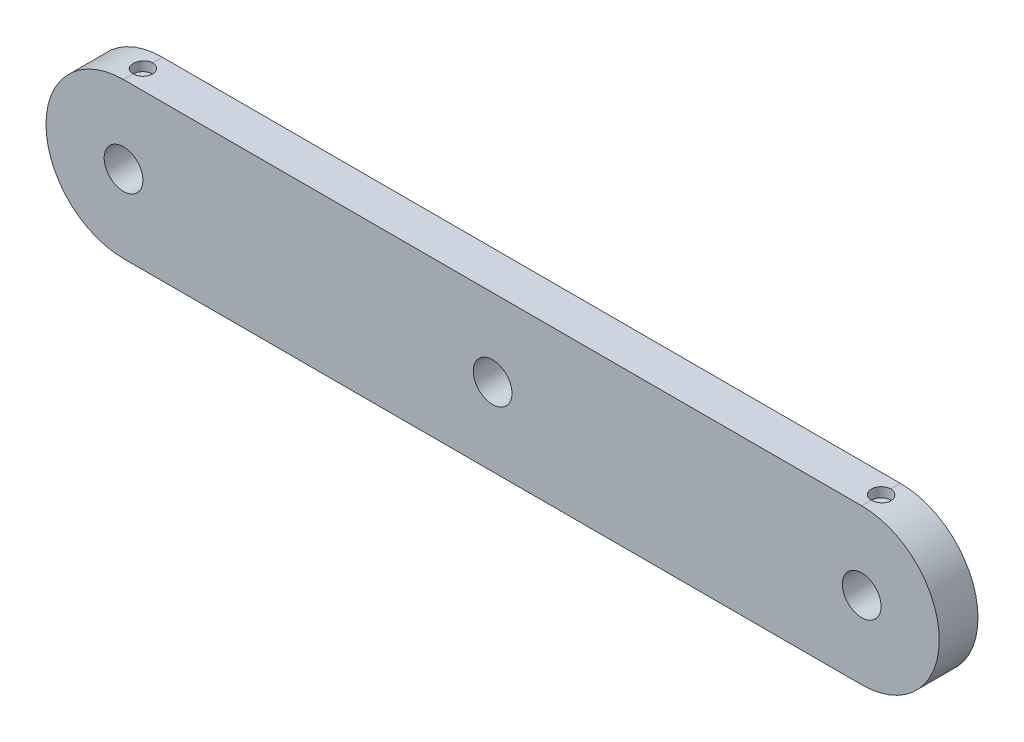
ISO-10303-21;
HEADER;
FILE_DESCRIPTION(('STEP AP214'),'2;1');
FILE_NAME('part.step','',(''),(''),'','','');
FILE_SCHEMA(('AUTOMOTIVE_DESIGN { 1 0 10303 214 1 1 1 1 }'));
ENDSEC;
DATA;
#1=APPLICATION_CONTEXT('core data for automotive mechanical design processes');
#2=APPLICATION_PROTOCOL_DEFINITION('international standard','automotive_design',2000,#1);
#3=PRODUCT_CONTEXT('',#1,'mechanical');
#4=PRODUCT('Part','Part','',(#3));
#5=PRODUCT_RELATED_PRODUCT_CATEGORY('part','',(#4));
#6=PRODUCT_DEFINITION_FORMATION('','',#4);
#7=PRODUCT_DEFINITION_CONTEXT('part definition',#1,'design');
#8=PRODUCT_DEFINITION('design','',#6,#7);
#9=PRODUCT_DEFINITION_SHAPE('','',#8);
#10=(LENGTH_UNIT() NAMED_UNIT(*) SI_UNIT(.MILLI.,.METRE.));
#11=(NAMED_UNIT(*) PLANE_ANGLE_UNIT() SI_UNIT($,.RADIAN.));
#12=(NAMED_UNIT(*) SI_UNIT($,.STERADIAN.) SOLID_ANGLE_UNIT());
#13=UNCERTAINTY_MEASURE_WITH_UNIT(LENGTH_MEASURE(1.E-05),#10,'distance_accuracy_value','');
#14=(GEOMETRIC_REPRESENTATION_CONTEXT(3) GLOBAL_UNCERTAINTY_ASSIGNED_CONTEXT((#13)) GLOBAL_UNIT_ASSIGNED_CONTEXT((#10,
#11,#12)) REPRESENTATION_CONTEXT('',''));
#15=CARTESIAN_POINT('',(0.,0.,0.));
#16=DIRECTION('',(0.,0.,1.));
#17=DIRECTION('',(1.,0.,0.));
#18=AXIS2_PLACEMENT_3D('',#15,#16,#17);
#19=CARTESIAN_POINT('',(-19.0419865714244,0.,2.));
#20=DIRECTION('',(0.,0.,1.));
#21=DIRECTION('',(1.,0.,0.));
#22=AXIS2_PLACEMENT_3D('',#19,#20,#21);
#23=PLANE('',#22);
#24=CARTESIAN_POINT('',(-19.0419865714244,0.,2.));
#25=DIRECTION('',(0.,0.,1.));
#26=DIRECTION('',(1.,0.,0.));
#27=AXIS2_PLACEMENT_3D('',#24,#25,#26);
#28=CIRCLE('',#27,0.999999999999943);
#29=CARTESIAN_POINT('',(-18.0419865714244,0.,2.));
#30=VERTEX_POINT('',#29);
#31=EDGE_CURVE('E133',#30,#30,#28,.T.);
#32=ORIENTED_EDGE('',*,*,#31,.F.);
#33=EDGE_LOOP('',(#32));
#34=FACE_BOUND('',#33,.T.);
#35=CARTESIAN_POINT('',(-19.0419865714244,0.,2.));
#36=DIRECTION('',(0.,0.,1.));
#37=DIRECTION('',(1.,0.,0.));
#38=AXIS2_PLACEMENT_3D('',#35,#36,#37);
#39=CIRCLE('',#38,3.99999999999989);
#40=CARTESIAN_POINT('',(-19.0419865714246,3.99999999999995,2.));
#41=VERTEX_POINT('',#40);
#42=CARTESIAN_POINT('',(-19.0419865714244,-3.99999999999984,2.));
#43=VERTEX_POINT('',#42);
#44=EDGE_CURVE('E114',#41,#43,#39,.T.);
#45=ORIENTED_EDGE('',*,*,#44,.T.);
#46=DIRECTION('',(1.,0.,0.));
#47=VECTOR('',#46,1.);
#48=CARTESIAN_POINT('',(-19.0419865714244,-3.99999999999984,2.));
#49=LINE('',#48,#47);
#50=CARTESIAN_POINT('',(19.0419865714246,-3.99999999999995,2.));
#51=VERTEX_POINT('',#50);
#52=EDGE_CURVE('E126',#43,#51,#49,.T.);
#53=ORIENTED_EDGE('',*,*,#52,.T.);
#54=CARTESIAN_POINT('',(19.0419865714246,0.,2.));
#55=DIRECTION('',(0.,0.,1.));
#56=DIRECTION('',(1.,0.,0.));
#57=AXIS2_PLACEMENT_3D('',#54,#55,#56);
#58=CIRCLE('',#57,3.99999999999989);
#59=CARTESIAN_POINT('',(19.0419865714246,3.99999999999995,2.));
#60=VERTEX_POINT('',#59);
#61=EDGE_CURVE('E124',#51,#60,#58,.T.);
#62=ORIENTED_EDGE('',*,*,#61,.T.);
#63=DIRECTION('',(-1.,0.,0.));
#64=VECTOR('',#63,1.);
#65=CARTESIAN_POINT('',(-19.0419865714246,3.99999999999995,2.));
#66=LINE('',#65,#64);
#67=EDGE_CURVE('E103',#60,#41,#66,.T.);
#68=ORIENTED_EDGE('',*,*,#67,.T.);
#69=EDGE_LOOP('',(#45,#53,#62,#68));
#70=FACE_BOUND('',#69,.T.);
#71=CARTESIAN_POINT('',(0.,0.,2.));
#72=DIRECTION('',(0.,0.,1.));
#73=DIRECTION('',(1.,0.,0.));
#74=AXIS2_PLACEMENT_3D('',#71,#72,#73);
#75=CIRCLE('',#74,1.00000000000007);
#76=CARTESIAN_POINT('',(1.00000000000007,0.,2.));
#77=VERTEX_POINT('',#76);
#78=EDGE_CURVE('E122',#77,#77,#75,.T.);
#79=ORIENTED_EDGE('',*,*,#78,.F.);
#80=EDGE_LOOP('',(#79));
#81=FACE_BOUND('',#80,.T.);
#82=CARTESIAN_POINT('',(19.0419865714246,0.,2.));
#83=DIRECTION('',(0.,0.,1.));
#84=DIRECTION('',(1.,0.,0.));
#85=AXIS2_PLACEMENT_3D('',#82,#83,#84);
#86=CIRCLE('',#85,1.00000000000007);
#87=CARTESIAN_POINT('',(20.0419865714247,0.,2.));
#88=VERTEX_POINT('',#87);
#89=EDGE_CURVE('E139',#88,#88,#86,.T.);
#90=ORIENTED_EDGE('',*,*,#89,.F.);
#91=EDGE_LOOP('',(#90));
#92=FACE_BOUND('',#91,.T.);
#93=ADVANCED_FACE('F32',(#34,#70,#81,#92),#23,.T.);
#94=CARTESIAN_POINT('',(-19.0419865714244,0.,0.));
#95=DIRECTION('',(0.,0.,1.));
#96=DIRECTION('',(1.,0.,0.));
#97=AXIS2_PLACEMENT_3D('',#94,#95,#96);
#98=PLANE('',#97);
#99=CARTESIAN_POINT('',(-19.0419865714244,0.,0.));
#100=DIRECTION('',(0.,0.,1.));
#101=DIRECTION('',(1.,0.,0.));
#102=AXIS2_PLACEMENT_3D('',#99,#100,#101);
#103=CIRCLE('',#102,0.999999999999943);
#104=CARTESIAN_POINT('',(-18.0419865714244,0.,0.));
#105=VERTEX_POINT('',#104);
#106=EDGE_CURVE('E136',#105,#105,#103,.T.);
#107=ORIENTED_EDGE('',*,*,#106,.T.);
#108=EDGE_LOOP('',(#107));
#109=FACE_BOUND('',#108,.T.);
#110=CARTESIAN_POINT('',(-19.0419865714244,0.,0.));
#111=DIRECTION('',(0.,0.,1.));
#112=DIRECTION('',(1.,0.,0.));
#113=AXIS2_PLACEMENT_3D('',#110,#111,#112);
#114=CIRCLE('',#113,3.99999999999989);
#115=CARTESIAN_POINT('',(-19.0419865714246,3.99999999999995,0.));
#116=VERTEX_POINT('',#115);
#117=CARTESIAN_POINT('',(-19.0419865714244,-3.99999999999984,0.));
#118=VERTEX_POINT('',#117);
#119=EDGE_CURVE('E119',#116,#118,#114,.T.);
#120=ORIENTED_EDGE('',*,*,#119,.F.);
#121=DIRECTION('',(-1.,0.,0.));
#122=VECTOR('',#121,1.);
#123=CARTESIAN_POINT('',(-19.0419865714246,3.99999999999995,0.));
#124=LINE('',#123,#122);
#125=CARTESIAN_POINT('',(19.0419865714246,3.99999999999995,0.));
#126=VERTEX_POINT('',#125);
#127=EDGE_CURVE('E111',#126,#116,#124,.T.);
#128=ORIENTED_EDGE('',*,*,#127,.F.);
#129=CARTESIAN_POINT('',(19.0419865714246,0.,0.));
#130=DIRECTION('',(0.,0.,1.));
#131=DIRECTION('',(1.,0.,0.));
#132=AXIS2_PLACEMENT_3D('',#129,#130,#131);
#133=CIRCLE('',#132,3.99999999999989);
#134=CARTESIAN_POINT('',(19.0419865714246,-3.99999999999995,0.));
#135=VERTEX_POINT('',#134);
#136=EDGE_CURVE('E115',#135,#126,#133,.T.);
#137=ORIENTED_EDGE('',*,*,#136,.F.);
#138=DIRECTION('',(1.,0.,0.));
#139=VECTOR('',#138,1.);
#140=CARTESIAN_POINT('',(-19.0419865714244,-3.99999999999984,0.));
#141=LINE('',#140,#139);
#142=EDGE_CURVE('E117',#118,#135,#141,.T.);
#143=ORIENTED_EDGE('',*,*,#142,.F.);
#144=EDGE_LOOP('',(#120,#128,#137,#143));
#145=FACE_BOUND('',#144,.T.);
#146=CARTESIAN_POINT('',(0.,0.,0.));
#147=DIRECTION('',(0.,0.,1.));
#148=DIRECTION('',(1.,0.,0.));
#149=AXIS2_PLACEMENT_3D('',#146,#147,#148);
#150=CIRCLE('',#149,1.00000000000007);
#151=CARTESIAN_POINT('',(1.00000000000007,0.,0.));
#152=VERTEX_POINT('',#151);
#153=EDGE_CURVE('E130',#152,#152,#150,.T.);
#154=ORIENTED_EDGE('',*,*,#153,.T.);
#155=EDGE_LOOP('',(#154));
#156=FACE_BOUND('',#155,.T.);
#157=CARTESIAN_POINT('',(19.0419865714246,0.,0.));
#158=DIRECTION('',(0.,0.,1.));
#159=DIRECTION('',(1.,0.,0.));
#160=AXIS2_PLACEMENT_3D('',#157,#158,#159);
#161=CIRCLE('',#160,1.00000000000007);
#162=CARTESIAN_POINT('',(20.0419865714247,0.,0.));
#163=VERTEX_POINT('',#162);
#164=EDGE_CURVE('E142',#163,#163,#161,.T.);
#165=ORIENTED_EDGE('',*,*,#164,.T.);
#166=EDGE_LOOP('',(#165));
#167=FACE_BOUND('',#166,.T.);
#168=ADVANCED_FACE('F176',(#109,#145,#156,#167),#98,.F.);
#169=CARTESIAN_POINT('',(-19.0419865714244,0.,2.));
#170=DIRECTION('',(0.,0.,-1.));
#171=DIRECTION('',(-1.,0.,0.));
#172=AXIS2_PLACEMENT_3D('',#169,#170,#171);
#173=CYLINDRICAL_SURFACE('',#172,3.99999999999989);
#174=DIRECTION('',(0.,0.,-1.));
#175=VECTOR('',#174,1.);
#176=CARTESIAN_POINT('',(-19.0419865714246,3.99999999999995,2.));
#177=LINE('',#176,#175);
#178=CARTESIAN_POINT('',(-19.0419865714246,3.99999999999995,1.5));
#179=VERTEX_POINT('',#178);
#180=EDGE_CURVE('E106',#41,#179,#177,.T.);
#181=ORIENTED_EDGE('',*,*,#180,.T.);
#182=CARTESIAN_POINT('',(-19.0419865714246,3.99999999999995,1.5));
#183=CARTESIAN_POINT('',(-19.0699998734899,4.00001123026525,1.50002440581871));
#184=CARTESIAN_POINT('',(-19.0980036185055,3.99970604622461,1.49764728285974));
#185=CARTESIAN_POINT('',(-19.1531862009609,3.99854617767852,1.48827289542741));
#186=CARTESIAN_POINT('',(-19.1803658762809,3.99769207235337,1.48128050043095));
#187=CARTESIAN_POINT('',(-19.2331655478784,3.99551700435899,1.46285473379586));
#188=CARTESIAN_POINT('',(-19.2587850250665,3.99419588729557,1.45141989335974));
#189=CARTESIAN_POINT('',(-19.3077400438985,3.99123732841575,1.42444747027317));
#190=CARTESIAN_POINT('',(-19.3310757686958,3.98959991199745,1.40891021700003));
#191=CARTESIAN_POINT('',(-19.3749280804125,3.98618079113776,1.37408264348786));
#192=CARTESIAN_POINT('',(-19.3954305473085,3.98439842970683,1.35477460670452));
#193=CARTESIAN_POINT('',(-19.4329153518104,3.98089561382974,1.31298972278445));
#194=CARTESIAN_POINT('',(-19.4498971468614,3.97917516895898,1.29051238813681));
#195=CARTESIAN_POINT('',(-19.4799090576034,3.97598456799428,1.24293530410356));
#196=CARTESIAN_POINT('',(-19.4929257663973,3.97451526827109,1.21782703514004));
#197=CARTESIAN_POINT('',(-19.5145516980932,3.97200219343723,1.16576098334992));
#198=CARTESIAN_POINT('',(-19.5231613493873,3.97095837696907,1.13880338057853));
#199=CARTESIAN_POINT('',(-19.5356862915746,3.96942068889684,1.08395149496283));
#200=CARTESIAN_POINT('',(-19.5396258189815,3.9689239789387,1.05606282729283));
#201=CARTESIAN_POINT('',(-19.5427737001535,3.96852805384939,1.00001543175915));
#202=CARTESIAN_POINT('',(-19.541982129521,3.96862882917048,0.971856708218097));
#203=CARTESIAN_POINT('',(-19.5357100104274,3.96941391186519,0.916238958358929));
#204=CARTESIAN_POINT('',(-19.5302562948609,3.97009487987534,0.88877685220304));
#205=CARTESIAN_POINT('',(-19.5148565931859,3.97195840572046,0.835160853734894));
#206=CARTESIAN_POINT('',(-19.5049105404861,3.97314097099076,0.809006980821387));
#207=CARTESIAN_POINT('',(-19.4807794306932,3.9758782615022,0.758665865594401));
#208=CARTESIAN_POINT('',(-19.4665826316928,3.97743401520964,0.734484309980567));
#209=CARTESIAN_POINT('',(-19.434362089603,3.98074149435642,0.688837755630672));
#210=CARTESIAN_POINT('',(-19.4163383331411,3.98249322048054,0.667372766387472));
#211=CARTESIAN_POINT('',(-19.3768293501971,3.98600997087511,0.62761436870434));
#212=CARTESIAN_POINT('',(-19.3553214596671,3.98777500470549,0.609343475917163));
#213=CARTESIAN_POINT('',(-19.3095250148149,3.99110876258182,0.576662560611256));
#214=CARTESIAN_POINT('',(-19.2852356392961,3.99267742836509,0.562253682517392));
#215=CARTESIAN_POINT('',(-19.234540894498,3.99544346494813,0.537704426238816));
#216=CARTESIAN_POINT('',(-19.2081335977972,3.99664049260012,0.527567989894497));
#217=CARTESIAN_POINT('',(-19.1540052779486,3.99852203511061,0.511898912154957));
#218=CARTESIAN_POINT('',(-19.1262862976615,3.99920732074057,0.506359345677845));
#219=CARTESIAN_POINT('',(-19.0796086998717,3.99986823220652,0.501058803856759));
#220=CARTESIAN_POINT('',(-19.0607932687395,4.000003833075,0.499990730311489));
#221=CARTESIAN_POINT('',(-19.0419865714246,3.99999999999995,0.500000000000001));
#222=B_SPLINE_CURVE_WITH_KNOTS('',3,(#182,#183,#184,#185,#186,#187,#188,#189,#190,#191,#192,
#193,#194,#195,#196,#197,#198,#199,#200,#201,#202,#203,#204,#205,#206,#207,#208,#209,#210,#211,
#212,#213,#214,#215,#216,#217,#218,#219,#220,#221),.UNSPECIFIED.,.F.,.F.,(4,2,2,2,2,2,2,2,2,2,2,
2,2,2,2,2,2,2,2,4),(0.,0.0839234479117966,0.167758491189171,0.251621276312826,0.335477330250437,
0.419737284805615,0.504010214648612,0.58856500676299,0.673111578088232,0.757217430472519,
0.841321938859883,0.924945619328749,1.00857053941938,1.09242862324256,1.17628700009416,
1.26071455726714,1.34516710513757,1.42969740096326,1.5141001214085,1.57051329024177),.UNSPECIFIED.);
#223=CARTESIAN_POINT('',(-19.0419865714246,3.99999999999995,0.500000000000001));
#224=VERTEX_POINT('',#223);
#225=EDGE_CURVE('E54',#179,#224,#222,.T.);
#226=ORIENTED_EDGE('',*,*,#225,.T.);
#227=EDGE_CURVE('E110',#224,#116,#177,.T.);
#228=ORIENTED_EDGE('',*,*,#227,.T.);
#229=ORIENTED_EDGE('',*,*,#119,.T.);
#230=DIRECTION('',(0.,0.,-1.));
#231=VECTOR('',#230,1.);
#232=CARTESIAN_POINT('',(-19.0419865714244,-3.99999999999984,2.));
#233=LINE('',#232,#231);
#234=EDGE_CURVE('E11',#43,#118,#233,.T.);
#235=ORIENTED_EDGE('',*,*,#234,.F.);
#236=ORIENTED_EDGE('',*,*,#44,.F.);
#237=EDGE_LOOP('',(#181,#226,#228,#229,#235,#236));
#238=FACE_BOUND('',#237,.T.);
#239=ADVANCED_FACE('F34',(#238),#173,.T.);
#240=CARTESIAN_POINT('',(-19.0419865714244,-3.99999999999984,2.));
#241=DIRECTION('',(0.,1.,0.));
#242=DIRECTION('',(0.,0.,1.));
#243=AXIS2_PLACEMENT_3D('',#240,#241,#242);
#244=PLANE('',#243);
#245=CARTESIAN_POINT('',(0.,-3.99999999999984,1.));
#246=DIRECTION('',(0.,-1.,0.));
#247=DIRECTION('',(0.,0.,-1.));
#248=AXIS2_PLACEMENT_3D('',#245,#246,#247);
#249=CIRCLE('',#248,0.5);
#250=CARTESIAN_POINT('',(0.,-3.99999999999984,0.5));
#251=VERTEX_POINT('',#250);
#252=EDGE_CURVE('E208',#251,#251,#249,.T.);
#253=ORIENTED_EDGE('',*,*,#252,.F.);
#254=EDGE_LOOP('',(#253));
#255=FACE_BOUND('',#254,.T.);
#256=ORIENTED_EDGE('',*,*,#142,.T.);
#257=DIRECTION('',(0.,0.,-1.));
#258=VECTOR('',#257,1.);
#259=CARTESIAN_POINT('',(19.0419865714246,-3.99999999999995,2.));
#260=LINE('',#259,#258);
#261=EDGE_CURVE('E41',#51,#135,#260,.T.);
#262=ORIENTED_EDGE('',*,*,#261,.F.);
#263=ORIENTED_EDGE('',*,*,#52,.F.);
#264=ORIENTED_EDGE('',*,*,#234,.T.);
#265=EDGE_LOOP('',(#256,#262,#263,#264));
#266=FACE_BOUND('',#265,.T.);
#267=ADVANCED_FACE('F185',(#255,#266),#244,.F.);
#268=CARTESIAN_POINT('',(19.0419865714246,0.,2.));
#269=DIRECTION('',(0.,0.,-1.));
#270=DIRECTION('',(-1.,0.,0.));
#271=AXIS2_PLACEMENT_3D('',#268,#269,#270);
#272=CYLINDRICAL_SURFACE('',#271,3.99999999999989);
#273=DIRECTION('',(0.,0.,-1.));
#274=VECTOR('',#273,1.);
#275=CARTESIAN_POINT('',(19.0419865714246,3.99999999999995,2.));
#276=LINE('',#275,#274);
#277=CARTESIAN_POINT('',(19.0419865714246,3.99999999999995,0.500000000000001));
#278=VERTEX_POINT('',#277);
#279=EDGE_CURVE('E98',#278,#126,#276,.T.);
#280=ORIENTED_EDGE('',*,*,#279,.F.);
#281=CARTESIAN_POINT('',(19.0419865714246,3.99999999999995,1.5));
#282=CARTESIAN_POINT('',(19.0140183523134,3.99999960979283,1.49999881181286));
#283=CARTESIAN_POINT('',(18.986032656564,3.99970356910968,1.49764542416614));
#284=CARTESIAN_POINT('',(18.9308400110066,3.99855108022252,1.48829444908584));
#285=CARTESIAN_POINT('',(18.9036339052998,3.99769404688268,1.48129201241532));
#286=CARTESIAN_POINT('',(18.850807456462,3.99551612208866,1.46285247121718));
#287=CARTESIAN_POINT('',(18.8251860593954,3.99419554291092,1.45141835163803));
#288=CARTESIAN_POINT('',(18.776230676446,3.99123740175603,1.42444654320604));
#289=CARTESIAN_POINT('',(18.7528962991133,3.98959989416807,1.40890955829386));
#290=CARTESIAN_POINT('',(18.7090440080383,3.98618064261249,1.37408161003208));
#291=CARTESIAN_POINT('',(18.6885404984372,3.98439822938467,1.35477257413075));
#292=CARTESIAN_POINT('',(18.6510560127131,3.98089545201934,1.31298743529267));
#293=CARTESIAN_POINT('',(18.6340752161461,3.97917509104837,1.29051117101735));
#294=CARTESIAN_POINT('',(18.6040645391678,3.97598461123901,1.24293600448687));
#295=CARTESIAN_POINT('',(18.5910481522364,3.97451535435566,1.21782852768641));
#296=CARTESIAN_POINT('',(18.5694219561096,3.9720022569152,1.16576258961053));
#297=CARTESIAN_POINT('',(18.5608119798115,3.97095840022611,1.1388041985706));
#298=CARTESIAN_POINT('',(18.5482867754196,3.96942067920706,1.08395116088265));
#299=CARTESIAN_POINT('',(18.5443472284782,3.96892396687333,1.05606214845917));
#300=CARTESIAN_POINT('',(18.5411994615131,3.96852805628542,1.00001474730564));
#301=CARTESIAN_POINT('',(18.5419910512241,3.96862883400285,0.971856369453747));
#302=CARTESIAN_POINT('',(18.548263124135,3.96941391073934,0.916239034550249));
#303=CARTESIAN_POINT('',(18.5537168188276,3.97009487592049,0.888777002759953));
#304=CARTESIAN_POINT('',(18.5691164947882,3.97195839951509,0.835160995756208));
#305=CARTESIAN_POINT('',(18.5790625670742,3.97314096809128,0.809007047057197));
#306=CARTESIAN_POINT('',(18.6031934594423,3.97587823172914,0.758666400195668));
#307=CARTESIAN_POINT('',(18.6173899206831,3.97743394642272,0.734485339950208));
#308=CARTESIAN_POINT('',(18.6496102775332,3.98074142286103,0.688838661117356));
#309=CARTESIAN_POINT('',(18.6676343482084,3.98249319357116,0.667373166805269));
#310=CARTESIAN_POINT('',(18.7071467492738,3.98601021978069,0.627611457855456));
#311=CARTESIAN_POINT('',(18.7286581698566,3.98777548477362,0.609338181646807));
#312=CARTESIAN_POINT('',(18.7744551376018,3.99110926511154,0.576658223993893));
#313=CARTESIAN_POINT('',(18.7987406911609,3.99267778000285,0.562251551465603));
#314=CARTESIAN_POINT('',(18.8494142371519,3.995442304437,0.53771373590722));
#315=CARTESIAN_POINT('',(18.875802932357,3.99663818880291,0.527584029223757));
#316=CARTESIAN_POINT('',(18.9299249833384,3.99852157155996,0.511905901295351));
#317=CARTESIAN_POINT('',(18.9576582760984,3.99920909375158,0.506357265572592));
#318=CARTESIAN_POINT('',(19.0134839386419,3.99999519282136,0.500028515147891));
#319=CARTESIAN_POINT('',(19.0415726733849,4.00009767228511,0.499216801527187));
#320=CARTESIAN_POINT('',(19.0974857787241,3.9997126760107,0.50230154681119));
#321=CARTESIAN_POINT('',(19.1253101549375,3.99922521283626,0.506197905450318));
#322=CARTESIAN_POINT('',(19.1798114729689,3.99771753751322,0.518561941754876));
#323=CARTESIAN_POINT('',(19.2064918855095,3.99669908162757,0.527014552680525));
#324=CARTESIAN_POINT('',(19.2580565023963,3.99424344620023,0.548235490382581));
#325=CARTESIAN_POINT('',(19.2829406457176,3.99280625244108,0.561003963698283));
#326=CARTESIAN_POINT('',(19.3303474755621,3.98966364582006,0.59057062750149));
#327=CARTESIAN_POINT('',(19.3528573234133,3.98795688808485,0.607389257961125));
#328=CARTESIAN_POINT('',(19.3947459693498,3.98447028465115,0.644549899506838));
#329=CARTESIAN_POINT('',(19.414124643092,3.98269043605363,0.664892050450196));
#330=CARTESIAN_POINT('',(19.4493129631882,3.97924621092501,0.708661483351426));
#331=CARTESIAN_POINT('',(19.4651016635382,3.97758254944249,0.732105669262076));
#332=CARTESIAN_POINT('',(19.4925171493133,3.97457082207413,0.781331648970939));
#333=CARTESIAN_POINT('',(19.5041440181703,3.97322274986189,0.8071133958953));
#334=CARTESIAN_POINT('',(19.5228718871979,3.97099970078583,0.860215063829519));
#335=CARTESIAN_POINT('',(19.529984696916,3.97012349036941,0.88753076600959));
#336=CARTESIAN_POINT('',(19.5395205701982,3.96893983181475,0.942980496756129));
#337=CARTESIAN_POINT('',(19.5419438519317,3.96863235721739,0.971114487191796));
#338=CARTESIAN_POINT('',(19.5420278786416,3.96862175396475,1.02719378584093));
#339=CARTESIAN_POINT('',(19.5397215309644,3.96891444950374,1.05513904966637));
#340=CARTESIAN_POINT('',(19.5304814523944,3.97006222907424,1.11024142586901));
#341=CARTESIAN_POINT('',(19.5235477210057,3.970917313166,1.13739853816175));
#342=CARTESIAN_POINT('',(19.5052599861625,3.97309223154894,1.19014939135327));
#343=CARTESIAN_POINT('',(19.4939075676188,3.9744118991854,1.21574368900436));
#344=CARTESIAN_POINT('',(19.4671079518546,3.97736756648947,1.26466933080966));
#345=CARTESIAN_POINT('',(19.4516607033265,3.97900357012066,1.28800064660396));
#346=CARTESIAN_POINT('',(19.4169878376778,3.9824212095043,1.33190624506809));
#347=CARTESIAN_POINT('',(19.3977376965796,3.9842037441679,1.35246109219099));
#348=CARTESIAN_POINT('',(19.3560566168183,3.98770566318564,1.39006136503359));
#349=CARTESIAN_POINT('',(19.3336249292529,3.98942503255102,1.40710596215486));
#350=CARTESIAN_POINT('',(19.2861196955954,3.99261411317333,1.43725707142106));
#351=CARTESIAN_POINT('',(19.2610364273438,3.99408285015644,1.45034836117985));
#352=CARTESIAN_POINT('',(19.2090231518848,3.99659529815329,1.47211424858325));
#353=CARTESIAN_POINT('',(19.1820951875986,3.997639470739,1.48079364527069));
#354=CARTESIAN_POINT('',(19.1361877258182,3.99893344065532,1.49141186763426));
#355=CARTESIAN_POINT('',(19.117497704128,3.99933145179072,1.49462778839641));
#356=CARTESIAN_POINT('',(19.0798699840671,3.99986486265824,1.49892224913864));
#357=CARTESIAN_POINT('',(19.0609322875238,4.00000026432687,1.50000080487986));
#358=CARTESIAN_POINT('',(19.0419865714246,3.99999999999995,1.5));
#359=B_SPLINE_CURVE_WITH_KNOTS('',3,(#281,#282,#283,#284,#285,#286,#287,#288,#289,#290,#291,
#292,#293,#294,#295,#296,#297,#298,#299,#300,#301,#302,#303,#304,#305,#306,#307,#308,#309,#310,
#311,#312,#313,#314,#315,#316,#317,#318,#319,#320,#321,#322,#323,#324,#325,#326,#327,#328,#329,
#330,#331,#332,#333,#334,#335,#336,#337,#338,#339,#340,#341,#342,#343,#344,#345,#346,#347,#348,
#349,#350,#351,#352,#353,#354,#355,#356,#357,#358),.UNSPECIFIED.,.T.,.F.,(4,2,2,2,2,2,2,2,2,2,2,
2,2,2,2,2,2,2,2,2,2,2,2,2,2,2,2,2,2,2,2,2,2,2,2,2,2,2,4),(0.,0.0838354545552498,
0.167758492188684,0.25162510163635,0.335477331182143,0.419741626403683,0.504010215600018,
0.588562500637734,0.673111578993608,0.757218450572636,0.841321939769322,0.924945392883377,
1.00857054033248,1.09242685257106,1.17628700102727,1.26072695627283,1.34516710622622,
1.4296355914632,1.51410012180756,1.59800055878383,1.68189920900385,1.76552210778678,
1.84914784615789,1.93320480585684,2.01726510275017,2.10180394301514,2.18634108844307,
2.27065614856184,2.35496728602124,2.43869380240442,2.52242032775909,2.60611684941297,
2.68981441982452,2.77407047538365,2.85834639694002,2.9429428060737,3.02744699736806,
3.08423768637525,3.14102795660087),.UNSPECIFIED.);
#360=CARTESIAN_POINT('',(19.0419865714246,3.99999999999995,1.5));
#361=VERTEX_POINT('',#360);
#362=EDGE_CURVE('E47',#278,#361,#359,.T.);
#363=ORIENTED_EDGE('',*,*,#362,.T.);
#364=EDGE_CURVE('E95',#60,#361,#276,.T.);
#365=ORIENTED_EDGE('',*,*,#364,.F.);
#366=ORIENTED_EDGE('',*,*,#61,.F.);
#367=ORIENTED_EDGE('',*,*,#261,.T.);
#368=ORIENTED_EDGE('',*,*,#136,.T.);
#369=EDGE_LOOP('',(#280,#363,#365,#366,#367,#368));
#370=FACE_BOUND('',#369,.T.);
#371=ADVANCED_FACE('F93',(#370),#272,.T.);
#372=CARTESIAN_POINT('',(-19.0419865714246,3.99999999999995,2.));
#373=DIRECTION('',(0.,-1.,0.));
#374=DIRECTION('',(0.,0.,-1.));
#375=AXIS2_PLACEMENT_3D('',#372,#373,#374);
#376=PLANE('',#375);
#377=ORIENTED_EDGE('',*,*,#364,.T.);
#378=CARTESIAN_POINT('',(19.0419865714246,3.99999999999995,1.));
#379=DIRECTION('',(0.,1.,0.));
#380=DIRECTION('',(0.,0.,-1.));
#381=AXIS2_PLACEMENT_3D('',#378,#379,#380);
#382=CIRCLE('',#381,0.499999999999999);
#383=EDGE_CURVE('E83',#278,#361,#382,.T.);
#384=ORIENTED_EDGE('',*,*,#383,.F.);
#385=ORIENTED_EDGE('',*,*,#279,.T.);
#386=ORIENTED_EDGE('',*,*,#127,.T.);
#387=ORIENTED_EDGE('',*,*,#227,.F.);
#388=CARTESIAN_POINT('',(-19.0419865714246,3.99999999999995,1.));
#389=DIRECTION('',(0.,1.,0.));
#390=DIRECTION('',(0.,0.,1.));
#391=AXIS2_PLACEMENT_3D('',#388,#389,#390);
#392=CIRCLE('',#391,0.499999999999999);
#393=EDGE_CURVE('E99',#179,#224,#392,.T.);
#394=ORIENTED_EDGE('',*,*,#393,.F.);
#395=ORIENTED_EDGE('',*,*,#180,.F.);
#396=ORIENTED_EDGE('',*,*,#67,.F.);
#397=EDGE_LOOP('',(#377,#384,#385,#386,#387,#394,#395,#396));
#398=FACE_BOUND('',#397,.T.);
#399=ADVANCED_FACE('F101',(#398),#376,.F.);
#400=CARTESIAN_POINT('',(0.,0.,2.));
#401=DIRECTION('',(0.,0.,-1.));
#402=DIRECTION('',(-1.,0.,0.));
#403=AXIS2_PLACEMENT_3D('',#400,#401,#402);
#404=CYLINDRICAL_SURFACE('',#403,1.00000000000007);
#405=ORIENTED_EDGE('',*,*,#78,.T.);
#406=EDGE_LOOP('',(#405));
#407=FACE_BOUND('',#406,.T.);
#408=ORIENTED_EDGE('',*,*,#153,.F.);
#409=EDGE_LOOP('',(#408));
#410=FACE_BOUND('',#409,.T.);
#411=ADVANCED_FACE('F169',(#407,#410),#404,.F.);
#412=CARTESIAN_POINT('',(-19.0419865714244,0.,2.));
#413=DIRECTION('',(0.,0.,-1.));
#414=DIRECTION('',(-1.,0.,0.));
#415=AXIS2_PLACEMENT_3D('',#412,#413,#414);
#416=CYLINDRICAL_SURFACE('',#415,0.999999999999943);
#417=ORIENTED_EDGE('',*,*,#31,.T.);
#418=EDGE_LOOP('',(#417));
#419=FACE_BOUND('',#418,.T.);
#420=ORIENTED_EDGE('',*,*,#106,.F.);
#421=EDGE_LOOP('',(#420));
#422=FACE_BOUND('',#421,.T.);
#423=ADVANCED_FACE('F165',(#419,#422),#416,.F.);
#424=CARTESIAN_POINT('',(19.0419865714246,0.,2.));
#425=DIRECTION('',(0.,0.,-1.));
#426=DIRECTION('',(-1.,0.,0.));
#427=AXIS2_PLACEMENT_3D('',#424,#425,#426);
#428=CYLINDRICAL_SURFACE('',#427,1.00000000000007);
#429=ORIENTED_EDGE('',*,*,#89,.T.);
#430=EDGE_LOOP('',(#429));
#431=FACE_BOUND('',#430,.T.);
#432=ORIENTED_EDGE('',*,*,#164,.F.);
#433=EDGE_LOOP('',(#432));
#434=FACE_BOUND('',#433,.T.);
#435=ADVANCED_FACE('F160',(#431,#434),#428,.F.);
#436=CARTESIAN_POINT('',(-19.0419865714246,3.49999999999995,1.));
#437=DIRECTION('',(0.,1.,0.));
#438=DIRECTION('',(0.,0.,1.));
#439=AXIS2_PLACEMENT_3D('',#436,#437,#438);
#440=CYLINDRICAL_SURFACE('',#439,0.499999999999999);
#441=CARTESIAN_POINT('',(-19.0419865714246,3.49999999999995,1.));
#442=DIRECTION('',(0.,1.,0.));
#443=DIRECTION('',(0.,0.,1.));
#444=AXIS2_PLACEMENT_3D('',#441,#442,#443);
#445=CIRCLE('',#444,0.499999999999999);
#446=CARTESIAN_POINT('',(-19.0419865714246,3.49999999999995,1.5));
#447=VERTEX_POINT('',#446);
#448=EDGE_CURVE('E152',#447,#447,#445,.T.);
#449=ORIENTED_EDGE('',*,*,#448,.F.);
#450=EDGE_LOOP('',(#449));
#451=FACE_BOUND('',#450,.T.);
#452=ORIENTED_EDGE('',*,*,#393,.T.);
#453=ORIENTED_EDGE('',*,*,#225,.F.);
#454=EDGE_LOOP('',(#452,#453));
#455=FACE_BOUND('',#454,.T.);
#456=ADVANCED_FACE('F154',(#451,#455),#440,.F.);
#457=CARTESIAN_POINT('',(-19.0419865714246,3.49999999999995,1.));
#458=DIRECTION('',(0.,1.,0.));
#459=DIRECTION('',(0.,0.,1.));
#460=AXIS2_PLACEMENT_3D('',#457,#458,#459);
#461=PLANE('',#460);
#462=ORIENTED_EDGE('',*,*,#448,.T.);
#463=EDGE_LOOP('',(#462));
#464=FACE_BOUND('',#463,.T.);
#465=ADVANCED_FACE('F159',(#464),#461,.T.);
#466=CARTESIAN_POINT('',(19.0419865714246,3.49999999999995,1.));
#467=DIRECTION('',(0.,1.,0.));
#468=DIRECTION('',(0.,0.,1.));
#469=AXIS2_PLACEMENT_3D('',#466,#467,#468);
#470=CYLINDRICAL_SURFACE('',#469,0.499999999999999);
#471=CARTESIAN_POINT('',(19.0419865714246,3.49999999999995,1.));
#472=DIRECTION('',(0.,1.,0.));
#473=DIRECTION('',(0.,0.,-1.));
#474=AXIS2_PLACEMENT_3D('',#471,#472,#473);
#475=CIRCLE('',#474,0.499999999999999);
#476=CARTESIAN_POINT('',(19.0419865714246,3.49999999999995,0.500000000000001));
#477=VERTEX_POINT('',#476);
#478=EDGE_CURVE('E88',#477,#477,#475,.T.);
#479=ORIENTED_EDGE('',*,*,#478,.F.);
#480=EDGE_LOOP('',(#479));
#481=FACE_BOUND('',#480,.T.);
#482=ORIENTED_EDGE('',*,*,#383,.T.);
#483=ORIENTED_EDGE('',*,*,#362,.F.);
#484=EDGE_LOOP('',(#482,#483));
#485=FACE_BOUND('',#484,.T.);
#486=ADVANCED_FACE('F84',(#481,#485),#470,.F.);
#487=CARTESIAN_POINT('',(19.0419865714246,3.49999999999995,1.));
#488=DIRECTION('',(0.,-1.,0.));
#489=DIRECTION('',(0.,0.,-1.));
#490=AXIS2_PLACEMENT_3D('',#487,#488,#489);
#491=PLANE('',#490);
#492=ORIENTED_EDGE('',*,*,#478,.T.);
#493=EDGE_LOOP('',(#492));
#494=FACE_BOUND('',#493,.T.);
#495=ADVANCED_FACE('F192',(#494),#491,.F.);
#496=CARTESIAN_POINT('',(0.,-3.49999999999984,1.));
#497=DIRECTION('',(0.,-1.,0.));
#498=DIRECTION('',(0.,0.,-1.));
#499=AXIS2_PLACEMENT_3D('',#496,#497,#498);
#500=CYLINDRICAL_SURFACE('',#499,0.5);
#501=CARTESIAN_POINT('',(0.,-3.49999999999984,1.));
#502=DIRECTION('',(0.,-1.,0.));
#503=DIRECTION('',(0.,0.,-1.));
#504=AXIS2_PLACEMENT_3D('',#501,#502,#503);
#505=CIRCLE('',#504,0.5);
#506=CARTESIAN_POINT('',(0.,-3.49999999999984,0.5));
#507=VERTEX_POINT('',#506);
#508=EDGE_CURVE('E89',#507,#507,#505,.T.);
#509=ORIENTED_EDGE('',*,*,#508,.F.);
#510=EDGE_LOOP('',(#509));
#511=FACE_BOUND('',#510,.T.);
#512=ORIENTED_EDGE('',*,*,#252,.T.);
#513=EDGE_LOOP('',(#512));
#514=FACE_BOUND('',#513,.T.);
#515=ADVANCED_FACE('F196',(#511,#514),#500,.F.);
#516=CARTESIAN_POINT('',(0.,-3.49999999999984,1.));
#517=DIRECTION('',(0.,-1.,0.));
#518=DIRECTION('',(0.,0.,-1.));
#519=AXIS2_PLACEMENT_3D('',#516,#517,#518);
#520=PLANE('',#519);
#521=ORIENTED_EDGE('',*,*,#508,.T.);
#522=EDGE_LOOP('',(#521));
#523=FACE_BOUND('',#522,.T.);
#524=ADVANCED_FACE('F200',(#523),#520,.T.);
#525=CLOSED_SHELL('',(#93,#168,#239,#267,#371,#399,#411,#423,#435,#456,#465,#486,#495,#515,#524));
#526=MANIFOLD_SOLID_BREP('B2',#525);
#527=ADVANCED_BREP_SHAPE_REPRESENTATION('',(#18,#526),#14);
#528=SHAPE_DEFINITION_REPRESENTATION(#9,#527);
ENDSEC;
END-ISO-10303-21;
